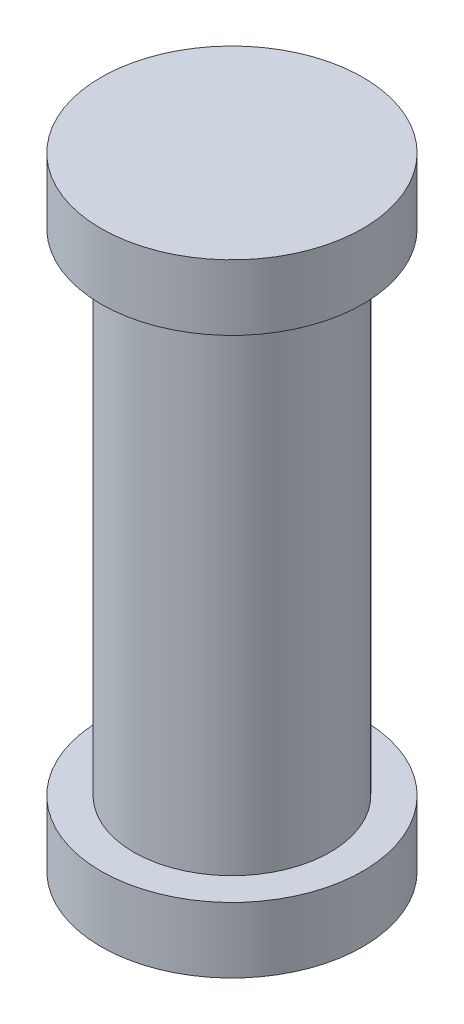
ISO-10303-21;
HEADER;
FILE_DESCRIPTION(('STEP AP214'),'2;1');
FILE_NAME('part.step','',(''),(''),'','','');
FILE_SCHEMA(('AUTOMOTIVE_DESIGN { 1 0 10303 214 1 1 1 1 }'));
ENDSEC;
DATA;
#1=APPLICATION_CONTEXT('core data for automotive mechanical design processes');
#2=APPLICATION_PROTOCOL_DEFINITION('international standard','automotive_design',2000,#1);
#3=PRODUCT_CONTEXT('',#1,'mechanical');
#4=PRODUCT('Part','Part','',(#3));
#5=PRODUCT_RELATED_PRODUCT_CATEGORY('part','',(#4));
#6=PRODUCT_DEFINITION_FORMATION('','',#4);
#7=PRODUCT_DEFINITION_CONTEXT('part definition',#1,'design');
#8=PRODUCT_DEFINITION('design','',#6,#7);
#9=PRODUCT_DEFINITION_SHAPE('','',#8);
#10=(LENGTH_UNIT() NAMED_UNIT(*) SI_UNIT(.MILLI.,.METRE.));
#11=(NAMED_UNIT(*) PLANE_ANGLE_UNIT() SI_UNIT($,.RADIAN.));
#12=(NAMED_UNIT(*) SI_UNIT($,.STERADIAN.) SOLID_ANGLE_UNIT());
#13=UNCERTAINTY_MEASURE_WITH_UNIT(LENGTH_MEASURE(1.E-05),#10,'distance_accuracy_value','');
#14=(GEOMETRIC_REPRESENTATION_CONTEXT(3) GLOBAL_UNCERTAINTY_ASSIGNED_CONTEXT((#13)) GLOBAL_UNIT_ASSIGNED_CONTEXT((#10,
#11,#12)) REPRESENTATION_CONTEXT('',''));
#15=CARTESIAN_POINT('',(0.,0.,0.));
#16=DIRECTION('',(0.,0.,1.));
#17=DIRECTION('',(1.,0.,0.));
#18=AXIS2_PLACEMENT_3D('',#15,#16,#17);
#19=CARTESIAN_POINT('',(0.,0.8,0.));
#20=DIRECTION('',(0.,-1.,0.));
#21=DIRECTION('',(0.,0.,-1.));
#22=AXIS2_PLACEMENT_3D('',#19,#20,#21);
#23=CYLINDRICAL_SURFACE('',#22,1.6);
#24=CARTESIAN_POINT('',(0.,0.8,0.));
#25=DIRECTION('',(0.,1.,0.));
#26=DIRECTION('',(0.,0.,1.));
#27=AXIS2_PLACEMENT_3D('',#24,#25,#26);
#28=CIRCLE('',#27,1.6);
#29=CARTESIAN_POINT('',(0.,0.8,1.6));
#30=VERTEX_POINT('',#29);
#31=EDGE_CURVE('E38',#30,#30,#28,.T.);
#32=ORIENTED_EDGE('',*,*,#31,.F.);
#33=EDGE_LOOP('',(#32));
#34=FACE_BOUND('',#33,.T.);
#35=CARTESIAN_POINT('',(0.,0.,0.));
#36=DIRECTION('',(0.,1.,0.));
#37=DIRECTION('',(0.,0.,1.));
#38=AXIS2_PLACEMENT_3D('',#35,#36,#37);
#39=CIRCLE('',#38,1.6);
#40=CARTESIAN_POINT('',(0.,0.,1.6));
#41=VERTEX_POINT('',#40);
#42=EDGE_CURVE('E34',#41,#41,#39,.T.);
#43=ORIENTED_EDGE('',*,*,#42,.T.);
#44=EDGE_LOOP('',(#43));
#45=FACE_BOUND('',#44,.T.);
#46=ADVANCED_FACE('F31',(#34,#45),#23,.T.);
#47=CARTESIAN_POINT('',(0.,0.8,0.));
#48=DIRECTION('',(0.,1.,0.));
#49=DIRECTION('',(0.,0.,1.));
#50=AXIS2_PLACEMENT_3D('',#47,#48,#49);
#51=PLANE('',#50);
#52=CARTESIAN_POINT('',(0.,0.8,0.));
#53=DIRECTION('',(0.,1.,0.));
#54=DIRECTION('',(0.,0.,1.));
#55=AXIS2_PLACEMENT_3D('',#52,#53,#54);
#56=CIRCLE('',#55,1.2);
#57=CARTESIAN_POINT('',(0.,0.8,1.2));
#58=VERTEX_POINT('',#57);
#59=EDGE_CURVE('E10',#58,#58,#56,.T.);
#60=ORIENTED_EDGE('',*,*,#59,.F.);
#61=EDGE_LOOP('',(#60));
#62=FACE_BOUND('',#61,.T.);
#63=ORIENTED_EDGE('',*,*,#31,.T.);
#64=EDGE_LOOP('',(#63));
#65=FACE_BOUND('',#64,.T.);
#66=ADVANCED_FACE('F72',(#62,#65),#51,.T.);
#67=CARTESIAN_POINT('',(0.,0.,0.));
#68=DIRECTION('',(0.,1.,0.));
#69=DIRECTION('',(0.,0.,1.));
#70=AXIS2_PLACEMENT_3D('',#67,#68,#69);
#71=PLANE('',#70);
#72=ORIENTED_EDGE('',*,*,#42,.F.);
#73=EDGE_LOOP('',(#72));
#74=FACE_BOUND('',#73,.T.);
#75=ADVANCED_FACE('F77',(#74),#71,.F.);
#76=CARTESIAN_POINT('',(0.,6.8,0.));
#77=DIRECTION('',(0.,-1.,0.));
#78=DIRECTION('',(0.,0.,-1.));
#79=AXIS2_PLACEMENT_3D('',#76,#77,#78);
#80=CYLINDRICAL_SURFACE('',#79,1.2);
#81=CARTESIAN_POINT('',(0.,6.8,0.));
#82=DIRECTION('',(0.,1.,0.));
#83=DIRECTION('',(0.,0.,1.));
#84=AXIS2_PLACEMENT_3D('',#81,#82,#83);
#85=CIRCLE('',#84,1.2);
#86=CARTESIAN_POINT('',(0.,6.8,1.2));
#87=VERTEX_POINT('',#86);
#88=EDGE_CURVE('E44',#87,#87,#85,.T.);
#89=ORIENTED_EDGE('',*,*,#88,.F.);
#90=EDGE_LOOP('',(#89));
#91=FACE_BOUND('',#90,.T.);
#92=ORIENTED_EDGE('',*,*,#59,.T.);
#93=EDGE_LOOP('',(#92));
#94=FACE_BOUND('',#93,.T.);
#95=ADVANCED_FACE('F59',(#91,#94),#80,.T.);
#96=CARTESIAN_POINT('',(0.,7.6,0.));
#97=DIRECTION('',(0.,-1.,0.));
#98=DIRECTION('',(0.,0.,-1.));
#99=AXIS2_PLACEMENT_3D('',#96,#97,#98);
#100=CYLINDRICAL_SURFACE('',#99,1.6);
#101=CARTESIAN_POINT('',(0.,7.6,0.));
#102=DIRECTION('',(0.,1.,0.));
#103=DIRECTION('',(0.,0.,1.));
#104=AXIS2_PLACEMENT_3D('',#101,#102,#103);
#105=CIRCLE('',#104,1.6);
#106=CARTESIAN_POINT('',(0.,7.6,1.6));
#107=VERTEX_POINT('',#106);
#108=EDGE_CURVE('E47',#107,#107,#105,.T.);
#109=ORIENTED_EDGE('',*,*,#108,.F.);
#110=EDGE_LOOP('',(#109));
#111=FACE_BOUND('',#110,.T.);
#112=CARTESIAN_POINT('',(0.,6.8,0.));
#113=DIRECTION('',(0.,1.,0.));
#114=DIRECTION('',(0.,0.,1.));
#115=AXIS2_PLACEMENT_3D('',#112,#113,#114);
#116=CIRCLE('',#115,1.6);
#117=CARTESIAN_POINT('',(0.,6.8,1.6));
#118=VERTEX_POINT('',#117);
#119=EDGE_CURVE('E48',#118,#118,#116,.T.);
#120=ORIENTED_EDGE('',*,*,#119,.T.);
#121=EDGE_LOOP('',(#120));
#122=FACE_BOUND('',#121,.T.);
#123=ADVANCED_FACE('F56',(#111,#122),#100,.T.);
#124=CARTESIAN_POINT('',(0.,7.6,0.));
#125=DIRECTION('',(0.,1.,0.));
#126=DIRECTION('',(0.,0.,1.));
#127=AXIS2_PLACEMENT_3D('',#124,#125,#126);
#128=PLANE('',#127);
#129=ORIENTED_EDGE('',*,*,#108,.T.);
#130=EDGE_LOOP('',(#129));
#131=FACE_BOUND('',#130,.T.);
#132=ADVANCED_FACE('F54',(#131),#128,.T.);
#133=CARTESIAN_POINT('',(0.,6.8,0.));
#134=DIRECTION('',(0.,1.,0.));
#135=DIRECTION('',(0.,0.,1.));
#136=AXIS2_PLACEMENT_3D('',#133,#134,#135);
#137=PLANE('',#136);
#138=ORIENTED_EDGE('',*,*,#88,.T.);
#139=EDGE_LOOP('',(#138));
#140=FACE_BOUND('',#139,.T.);
#141=ORIENTED_EDGE('',*,*,#119,.F.);
#142=EDGE_LOOP('',(#141));
#143=FACE_BOUND('',#142,.T.);
#144=ADVANCED_FACE('F63',(#140,#143),#137,.F.);
#145=CLOSED_SHELL('',(#46,#66,#75,#95,#123,#132,#144));
#146=MANIFOLD_SOLID_BREP('B2',#145);
#147=ADVANCED_BREP_SHAPE_REPRESENTATION('',(#18,#146),#14);
#148=SHAPE_DEFINITION_REPRESENTATION(#9,#147);
ENDSEC;
END-ISO-10303-21;
